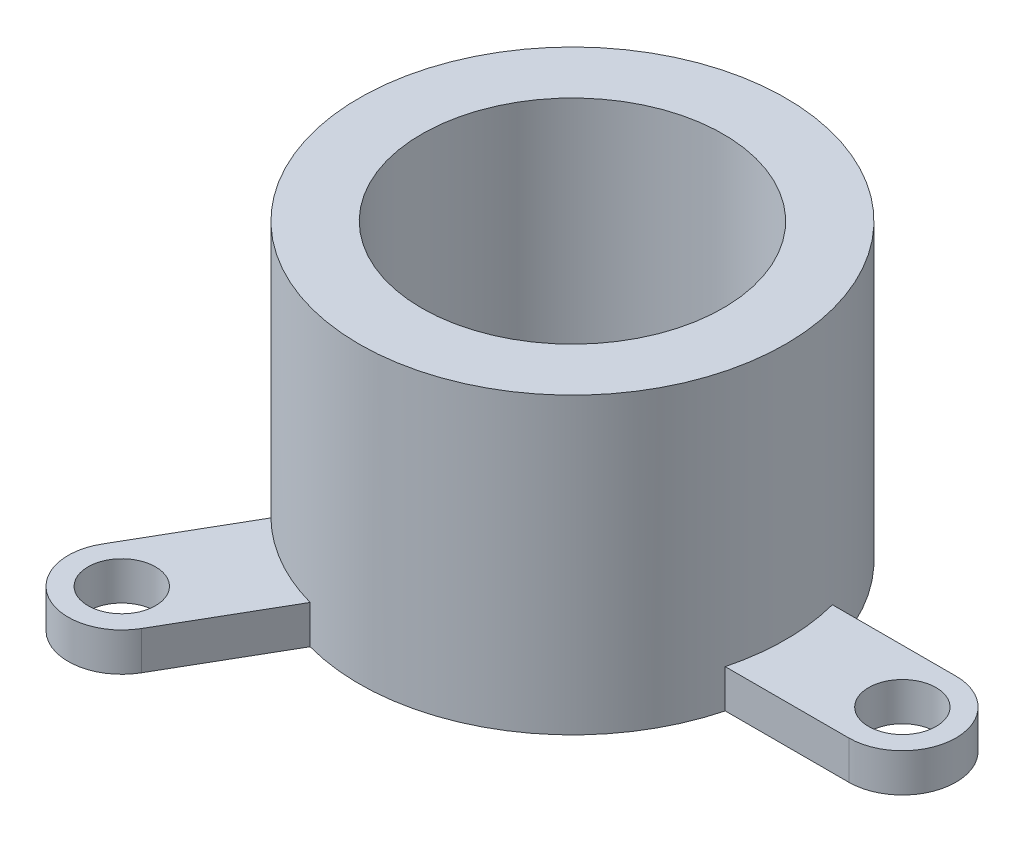
ISO-10303-21;
HEADER;
FILE_DESCRIPTION(('STEP AP214'),'2;1');
FILE_NAME('part.step','',(''),(''),'','','');
FILE_SCHEMA(('AUTOMOTIVE_DESIGN { 1 0 10303 214 1 1 1 1 }'));
ENDSEC;
DATA;
#1=APPLICATION_CONTEXT('core data for automotive mechanical design processes');
#2=APPLICATION_PROTOCOL_DEFINITION('international standard','automotive_design',2000,#1);
#3=PRODUCT_CONTEXT('',#1,'mechanical');
#4=PRODUCT('Part','Part','',(#3));
#5=PRODUCT_RELATED_PRODUCT_CATEGORY('part','',(#4));
#6=PRODUCT_DEFINITION_FORMATION('','',#4);
#7=PRODUCT_DEFINITION_CONTEXT('part definition',#1,'design');
#8=PRODUCT_DEFINITION('design','',#6,#7);
#9=PRODUCT_DEFINITION_SHAPE('','',#8);
#10=(LENGTH_UNIT() NAMED_UNIT(*) SI_UNIT(.MILLI.,.METRE.));
#11=(NAMED_UNIT(*) PLANE_ANGLE_UNIT() SI_UNIT($,.RADIAN.));
#12=(NAMED_UNIT(*) SI_UNIT($,.STERADIAN.) SOLID_ANGLE_UNIT());
#13=UNCERTAINTY_MEASURE_WITH_UNIT(LENGTH_MEASURE(1.E-05),#10,'distance_accuracy_value','');
#14=(GEOMETRIC_REPRESENTATION_CONTEXT(3) GLOBAL_UNCERTAINTY_ASSIGNED_CONTEXT((#13)) GLOBAL_UNIT_ASSIGNED_CONTEXT((#10,
#11,#12)) REPRESENTATION_CONTEXT('',''));
#15=CARTESIAN_POINT('',(0.,0.,0.));
#16=DIRECTION('',(0.,0.,1.));
#17=DIRECTION('',(1.,0.,0.));
#18=AXIS2_PLACEMENT_3D('',#15,#16,#17);
#19=CARTESIAN_POINT('',(0.,69.,0.));
#20=DIRECTION('',(0.,1.,0.));
#21=DIRECTION('',(0.,0.,1.));
#22=AXIS2_PLACEMENT_3D('',#19,#20,#21);
#23=PLANE('',#22);
#24=CARTESIAN_POINT('',(0.,69.,0.));
#25=DIRECTION('',(0.,1.,0.));
#26=DIRECTION('',(0.,0.,1.));
#27=AXIS2_PLACEMENT_3D('',#24,#25,#26);
#28=CIRCLE('',#27,50.);
#29=CARTESIAN_POINT('',(0.,69.,50.));
#30=VERTEX_POINT('',#29);
#31=EDGE_CURVE('E11',#30,#30,#28,.T.);
#32=ORIENTED_EDGE('',*,*,#31,.T.);
#33=EDGE_LOOP('',(#32));
#34=FACE_BOUND('',#33,.T.);
#35=CARTESIAN_POINT('',(0.,69.,0.));
#36=DIRECTION('',(0.,1.,0.));
#37=DIRECTION('',(0.,0.,1.));
#38=AXIS2_PLACEMENT_3D('',#35,#36,#37);
#39=CIRCLE('',#38,35.3553390593274);
#40=CARTESIAN_POINT('',(0.,69.,35.3553390593274));
#41=VERTEX_POINT('',#40);
#42=EDGE_CURVE('E233',#41,#41,#39,.T.);
#43=ORIENTED_EDGE('',*,*,#42,.F.);
#44=EDGE_LOOP('',(#43));
#45=FACE_BOUND('',#44,.T.);
#46=ADVANCED_FACE('F33',(#34,#45),#23,.T.);
#47=CARTESIAN_POINT('',(0.,0.,0.));
#48=DIRECTION('',(0.,1.,0.));
#49=DIRECTION('',(0.,0.,1.));
#50=AXIS2_PLACEMENT_3D('',#47,#48,#49);
#51=PLANE('',#50);
#52=CARTESIAN_POINT('',(0.,0.,0.));
#53=DIRECTION('',(0.,1.,0.));
#54=DIRECTION('',(0.,0.,1.));
#55=AXIS2_PLACEMENT_3D('',#52,#53,#54);
#56=CIRCLE('',#55,50.);
#57=CARTESIAN_POINT('',(48.3955633466447,0.,-12.564610951434));
#58=VERTEX_POINT('',#57);
#59=CARTESIAN_POINT('',(-13.3165094007126,0.,-48.1940927643703));
#60=VERTEX_POINT('',#59);
#61=EDGE_CURVE('E37',#58,#60,#56,.T.);
#62=ORIENTED_EDGE('',*,*,#61,.F.);
#63=DIRECTION('',(1.,0.,0.));
#64=VECTOR('',#63,1.);
#65=CARTESIAN_POINT('',(77.3632297465945,0.,-12.564610951434));
#66=LINE('',#65,#64);
#67=CARTESIAN_POINT('',(77.3632297465945,0.,-12.564610951434));
#68=VERTEX_POINT('',#67);
#69=EDGE_CURVE('E207',#58,#68,#66,.T.);
#70=ORIENTED_EDGE('',*,*,#69,.T.);
#71=CARTESIAN_POINT('',(77.3632297465945,0.,0.));
#72=DIRECTION('',(0.,-1.,0.));
#73=DIRECTION('',(0.,0.,-1.));
#74=AXIS2_PLACEMENT_3D('',#71,#72,#73);
#75=CIRCLE('',#74,12.564610951434);
#76=CARTESIAN_POINT('',(77.3632297465945,0.,12.564610951434));
#77=VERTEX_POINT('',#76);
#78=EDGE_CURVE('E200',#68,#77,#75,.T.);
#79=ORIENTED_EDGE('',*,*,#78,.T.);
#80=DIRECTION('',(-1.,0.,0.));
#81=VECTOR('',#80,1.);
#82=CARTESIAN_POINT('',(77.3632297465945,0.,12.564610951434));
#83=LINE('',#82,#81);
#84=CARTESIAN_POINT('',(48.3955633466447,0.,12.564610951434));
#85=VERTEX_POINT('',#84);
#86=EDGE_CURVE('E218',#77,#85,#83,.T.);
#87=ORIENTED_EDGE('',*,*,#86,.T.);
#88=CARTESIAN_POINT('',(-13.3165094007119,0.,48.1940927643705));
#89=VERTEX_POINT('',#88);
#90=EDGE_CURVE('E236',#89,#85,#56,.T.);
#91=ORIENTED_EDGE('',*,*,#90,.F.);
#92=DIRECTION('',(-0.499999999999992,0.,0.866025403784443));
#93=VECTOR('',#92,1.);
#94=CARTESIAN_POINT('',(-27.8003426006865,0.,73.28082775508));
#95=LINE('',#94,#93);
#96=CARTESIAN_POINT('',(-27.8003426006865,0.,73.28082775508));
#97=VERTEX_POINT('',#96);
#98=EDGE_CURVE('E142',#89,#97,#95,.T.);
#99=ORIENTED_EDGE('',*,*,#98,.T.);
#100=CARTESIAN_POINT('',(-38.6816148732966,0.,66.9985222793631));
#101=DIRECTION('',(0.,-1.,0.));
#102=DIRECTION('',(0.866025403784443,0.,0.499999999999992));
#103=AXIS2_PLACEMENT_3D('',#100,#101,#102);
#104=CIRCLE('',#103,12.564610951434);
#105=CARTESIAN_POINT('',(-49.5628871459067,0.,60.7162168036462));
#106=VERTEX_POINT('',#105);
#107=EDGE_CURVE('E152',#97,#106,#104,.T.);
#108=ORIENTED_EDGE('',*,*,#107,.T.);
#109=DIRECTION('',(0.499999999999992,0.,-0.866025403784443));
#110=VECTOR('',#109,1.);
#111=CARTESIAN_POINT('',(-49.5628871459067,0.,60.7162168036462));
#112=LINE('',#111,#110);
#113=CARTESIAN_POINT('',(-35.0790539459321,0.,35.6294818129367));
#114=VERTEX_POINT('',#113);
#115=EDGE_CURVE('E126',#106,#114,#112,.T.);
#116=ORIENTED_EDGE('',*,*,#115,.T.);
#117=CARTESIAN_POINT('',(-35.0790539459326,0.,-35.6294818129362));
#118=VERTEX_POINT('',#117);
#119=EDGE_CURVE('E270',#118,#114,#56,.T.);
#120=ORIENTED_EDGE('',*,*,#119,.F.);
#121=DIRECTION('',(-0.500000000000004,0.,-0.866025403784436));
#122=VECTOR('',#121,1.);
#123=CARTESIAN_POINT('',(-49.5628871459075,0.,-60.7162168036455));
#124=LINE('',#123,#122);
#125=CARTESIAN_POINT('',(-49.5628871459075,0.,-60.7162168036455));
#126=VERTEX_POINT('',#125);
#127=EDGE_CURVE('E171',#118,#126,#124,.T.);
#128=ORIENTED_EDGE('',*,*,#127,.T.);
#129=CARTESIAN_POINT('',(-38.6816148732975,0.,-66.9985222793626));
#130=DIRECTION('',(0.,-1.,0.));
#131=DIRECTION('',(-0.866025403784436,0.,0.500000000000004));
#132=AXIS2_PLACEMENT_3D('',#129,#130,#131);
#133=CIRCLE('',#132,12.564610951434);
#134=CARTESIAN_POINT('',(-27.8003426006876,0.,-73.2808277550796));
#135=VERTEX_POINT('',#134);
#136=EDGE_CURVE('E164',#126,#135,#133,.T.);
#137=ORIENTED_EDGE('',*,*,#136,.T.);
#138=DIRECTION('',(0.500000000000004,0.,0.866025403784437));
#139=VECTOR('',#138,1.);
#140=CARTESIAN_POINT('',(-27.8003426006876,0.,-73.2808277550796));
#141=LINE('',#140,#139);
#142=EDGE_CURVE('E182',#135,#60,#141,.T.);
#143=ORIENTED_EDGE('',*,*,#142,.T.);
#144=EDGE_LOOP('',(#62,#70,#79,#87,#91,#99,#108,#116,#120,#128,#137,#143));
#145=FACE_BOUND('',#144,.T.);
#146=CARTESIAN_POINT('',(0.,0.,0.));
#147=DIRECTION('',(0.,1.,0.));
#148=DIRECTION('',(0.,0.,1.));
#149=AXIS2_PLACEMENT_3D('',#146,#147,#148);
#150=CIRCLE('',#149,35.3553390593274);
#151=CARTESIAN_POINT('',(0.,0.,35.3553390593274));
#152=VERTEX_POINT('',#151);
#153=EDGE_CURVE('E225',#152,#152,#150,.T.);
#154=ORIENTED_EDGE('',*,*,#153,.T.);
#155=EDGE_LOOP('',(#154));
#156=FACE_BOUND('',#155,.T.);
#157=CARTESIAN_POINT('',(77.3632297465945,0.,0.));
#158=DIRECTION('',(0.,-1.,0.));
#159=DIRECTION('',(0.,0.,-1.));
#160=AXIS2_PLACEMENT_3D('',#157,#158,#159);
#161=CIRCLE('',#160,7.91120778203049);
#162=CARTESIAN_POINT('',(77.3632297465945,0.,-7.91120778203049));
#163=VERTEX_POINT('',#162);
#164=EDGE_CURVE('E189',#163,#163,#161,.T.);
#165=ORIENTED_EDGE('',*,*,#164,.F.);
#166=EDGE_LOOP('',(#165));
#167=FACE_BOUND('',#166,.T.);
#168=CARTESIAN_POINT('',(-38.6816148732975,0.,-66.9985222793626));
#169=DIRECTION('',(0.,-1.,0.));
#170=DIRECTION('',(-0.866025403784436,0.,0.500000000000004));
#171=AXIS2_PLACEMENT_3D('',#168,#169,#170);
#172=CIRCLE('',#171,7.91120778203049);
#173=CARTESIAN_POINT('',(-45.5329217871531,0.,-63.0429183883473));
#174=VERTEX_POINT('',#173);
#175=EDGE_CURVE('E157',#174,#174,#172,.T.);
#176=ORIENTED_EDGE('',*,*,#175,.F.);
#177=EDGE_LOOP('',(#176));
#178=FACE_BOUND('',#177,.T.);
#179=CARTESIAN_POINT('',(-38.6816148732966,0.,66.9985222793631));
#180=DIRECTION('',(0.,-1.,0.));
#181=DIRECTION('',(0.866025403784443,0.,0.499999999999992));
#182=AXIS2_PLACEMENT_3D('',#179,#180,#181);
#183=CIRCLE('',#182,7.91120778203049);
#184=CARTESIAN_POINT('',(-31.830307959441,0.,70.9541261703783));
#185=VERTEX_POINT('',#184);
#186=EDGE_CURVE('E147',#185,#185,#183,.T.);
#187=ORIENTED_EDGE('',*,*,#186,.F.);
#188=EDGE_LOOP('',(#187));
#189=FACE_BOUND('',#188,.T.);
#190=ADVANCED_FACE('F240',(#145,#156,#167,#178,#189),#51,.F.);
#191=CARTESIAN_POINT('',(0.,69.,0.));
#192=DIRECTION('',(0.,-1.,0.));
#193=DIRECTION('',(0.,0.,-1.));
#194=AXIS2_PLACEMENT_3D('',#191,#192,#193);
#195=CYLINDRICAL_SURFACE('',#194,50.);
#196=ORIENTED_EDGE('',*,*,#31,.F.);
#197=EDGE_LOOP('',(#196));
#198=FACE_BOUND('',#197,.T.);
#199=CARTESIAN_POINT('',(0.,8.99999999999998,0.));
#200=DIRECTION('',(0.,1.,0.));
#201=DIRECTION('',(0.866025403784443,0.,0.499999999999992));
#202=AXIS2_PLACEMENT_3D('',#199,#200,#201);
#203=CIRCLE('',#202,50.);
#204=CARTESIAN_POINT('',(-35.0790539459321,8.99999999999998,35.6294818129367));
#205=VERTEX_POINT('',#204);
#206=CARTESIAN_POINT('',(-13.3165094007119,8.99999999999998,48.1940927643705));
#207=VERTEX_POINT('',#206);
#208=EDGE_CURVE('E52',#205,#207,#203,.T.);
#209=ORIENTED_EDGE('',*,*,#208,.T.);
#210=DIRECTION('',(0.,-1.,0.));
#211=VECTOR('',#210,1.);
#212=CARTESIAN_POINT('',(-13.3165094007119,8.99999999999998,48.1940927643705));
#213=LINE('',#212,#211);
#214=EDGE_CURVE('E158',#207,#89,#213,.T.);
#215=ORIENTED_EDGE('',*,*,#214,.T.);
#216=ORIENTED_EDGE('',*,*,#90,.T.);
#217=DIRECTION('',(0.,-1.,0.));
#218=VECTOR('',#217,1.);
#219=CARTESIAN_POINT('',(48.3955633466447,8.99999999999998,12.564610951434));
#220=LINE('',#219,#218);
#221=CARTESIAN_POINT('',(48.3955633466447,8.99999999999998,12.564610951434));
#222=VERTEX_POINT('',#221);
#223=EDGE_CURVE('E229',#222,#85,#220,.T.);
#224=ORIENTED_EDGE('',*,*,#223,.F.);
#225=CARTESIAN_POINT('',(0.,8.99999999999998,0.));
#226=DIRECTION('',(0.,1.,0.));
#227=DIRECTION('',(0.,0.,-1.));
#228=AXIS2_PLACEMENT_3D('',#225,#226,#227);
#229=CIRCLE('',#228,50.);
#230=CARTESIAN_POINT('',(48.3955633466448,8.99999999999998,-12.564610951434));
#231=VERTEX_POINT('',#230);
#232=EDGE_CURVE('E210',#222,#231,#229,.T.);
#233=ORIENTED_EDGE('',*,*,#232,.T.);
#234=DIRECTION('',(0.,-1.,0.));
#235=VECTOR('',#234,1.);
#236=CARTESIAN_POINT('',(48.3955633466447,8.99999999999998,-12.564610951434));
#237=LINE('',#236,#235);
#238=EDGE_CURVE('E226',#231,#58,#237,.T.);
#239=ORIENTED_EDGE('',*,*,#238,.T.);
#240=ORIENTED_EDGE('',*,*,#61,.T.);
#241=DIRECTION('',(0.,-1.,0.));
#242=VECTOR('',#241,1.);
#243=CARTESIAN_POINT('',(-13.3165094007126,8.99999999999998,-48.1940927643703));
#244=LINE('',#243,#242);
#245=CARTESIAN_POINT('',(-13.3165094007126,8.99999999999998,-48.1940927643703));
#246=VERTEX_POINT('',#245);
#247=EDGE_CURVE('E193',#246,#60,#244,.T.);
#248=ORIENTED_EDGE('',*,*,#247,.F.);
#249=CARTESIAN_POINT('',(0.,8.99999999999998,0.));
#250=DIRECTION('',(0.,1.,0.));
#251=DIRECTION('',(-0.866025403784436,0.,0.500000000000004));
#252=AXIS2_PLACEMENT_3D('',#249,#250,#251);
#253=CIRCLE('',#252,50.);
#254=CARTESIAN_POINT('',(-35.0790539459326,8.99999999999998,-35.6294818129362));
#255=VERTEX_POINT('',#254);
#256=EDGE_CURVE('E174',#246,#255,#253,.T.);
#257=ORIENTED_EDGE('',*,*,#256,.T.);
#258=DIRECTION('',(0.,-1.,0.));
#259=VECTOR('',#258,1.);
#260=CARTESIAN_POINT('',(-35.0790539459326,8.99999999999998,-35.6294818129362));
#261=LINE('',#260,#259);
#262=EDGE_CURVE('E190',#255,#118,#261,.T.);
#263=ORIENTED_EDGE('',*,*,#262,.T.);
#264=ORIENTED_EDGE('',*,*,#119,.T.);
#265=DIRECTION('',(0.,-1.,0.));
#266=VECTOR('',#265,1.);
#267=CARTESIAN_POINT('',(-35.0790539459321,8.99999999999998,35.6294818129367));
#268=LINE('',#267,#266);
#269=EDGE_CURVE('E48',#205,#114,#268,.T.);
#270=ORIENTED_EDGE('',*,*,#269,.F.);
#271=EDGE_LOOP('',(#209,#215,#216,#224,#233,#239,#240,#248,#257,#263,#264,#270));
#272=FACE_BOUND('',#271,.T.);
#273=ADVANCED_FACE('F35',(#198,#272),#195,.T.);
#274=CARTESIAN_POINT('',(0.,69.,0.));
#275=DIRECTION('',(0.,-1.,0.));
#276=DIRECTION('',(0.,0.,-1.));
#277=AXIS2_PLACEMENT_3D('',#274,#275,#276);
#278=CYLINDRICAL_SURFACE('',#277,35.3553390593274);
#279=ORIENTED_EDGE('',*,*,#42,.T.);
#280=EDGE_LOOP('',(#279));
#281=FACE_BOUND('',#280,.T.);
#282=ORIENTED_EDGE('',*,*,#153,.F.);
#283=EDGE_LOOP('',(#282));
#284=FACE_BOUND('',#283,.T.);
#285=ADVANCED_FACE('F243',(#281,#284),#278,.F.);
#286=CARTESIAN_POINT('',(77.3632297465945,8.99999999999998,0.));
#287=DIRECTION('',(0.,-1.,0.));
#288=DIRECTION('',(0.,0.,-1.));
#289=AXIS2_PLACEMENT_3D('',#286,#287,#288);
#290=CYLINDRICAL_SURFACE('',#289,12.564610951434);
#291=ORIENTED_EDGE('',*,*,#78,.F.);
#292=DIRECTION('',(0.,-1.,0.));
#293=VECTOR('',#292,1.);
#294=CARTESIAN_POINT('',(77.3632297465945,8.99999999999998,-12.564610951434));
#295=LINE('',#294,#293);
#296=CARTESIAN_POINT('',(77.3632297465945,8.99999999999998,-12.564610951434));
#297=VERTEX_POINT('',#296);
#298=EDGE_CURVE('E223',#297,#68,#295,.T.);
#299=ORIENTED_EDGE('',*,*,#298,.F.);
#300=CARTESIAN_POINT('',(77.3632297465945,8.99999999999998,0.));
#301=DIRECTION('',(0.,-1.,0.));
#302=DIRECTION('',(0.,0.,-1.));
#303=AXIS2_PLACEMENT_3D('',#300,#301,#302);
#304=CIRCLE('',#303,12.564610951434);
#305=CARTESIAN_POINT('',(77.3632297465945,8.99999999999998,12.564610951434));
#306=VERTEX_POINT('',#305);
#307=EDGE_CURVE('E203',#297,#306,#304,.T.);
#308=ORIENTED_EDGE('',*,*,#307,.T.);
#309=DIRECTION('',(0.,-1.,0.));
#310=VECTOR('',#309,1.);
#311=CARTESIAN_POINT('',(77.3632297465945,8.99999999999998,12.564610951434));
#312=LINE('',#311,#310);
#313=EDGE_CURVE('E215',#306,#77,#312,.T.);
#314=ORIENTED_EDGE('',*,*,#313,.T.);
#315=EDGE_LOOP('',(#291,#299,#308,#314));
#316=FACE_BOUND('',#315,.T.);
#317=ADVANCED_FACE('F245',(#316),#290,.T.);
#318=CARTESIAN_POINT('',(77.3632297465945,8.99999999999998,-12.564610951434));
#319=DIRECTION('',(0.,0.,-1.));
#320=DIRECTION('',(-1.,0.,0.));
#321=AXIS2_PLACEMENT_3D('',#318,#319,#320);
#322=PLANE('',#321);
#323=ORIENTED_EDGE('',*,*,#69,.F.);
#324=ORIENTED_EDGE('',*,*,#238,.F.);
#325=DIRECTION('',(1.,0.,0.));
#326=VECTOR('',#325,1.);
#327=CARTESIAN_POINT('',(77.3632297465945,8.99999999999998,-12.564610951434));
#328=LINE('',#327,#326);
#329=EDGE_CURVE('E212',#231,#297,#328,.T.);
#330=ORIENTED_EDGE('',*,*,#329,.T.);
#331=ORIENTED_EDGE('',*,*,#298,.T.);
#332=EDGE_LOOP('',(#323,#324,#330,#331));
#333=FACE_BOUND('',#332,.T.);
#334=ADVANCED_FACE('F252',(#333),#322,.T.);
#335=CARTESIAN_POINT('',(77.3632297465945,8.99999999999998,12.564610951434));
#336=DIRECTION('',(0.,0.,1.));
#337=DIRECTION('',(1.,0.,0.));
#338=AXIS2_PLACEMENT_3D('',#335,#336,#337);
#339=PLANE('',#338);
#340=ORIENTED_EDGE('',*,*,#86,.F.);
#341=ORIENTED_EDGE('',*,*,#313,.F.);
#342=DIRECTION('',(-1.,0.,0.));
#343=VECTOR('',#342,1.);
#344=CARTESIAN_POINT('',(77.3632297465945,8.99999999999998,12.564610951434));
#345=LINE('',#344,#343);
#346=EDGE_CURVE('E206',#306,#222,#345,.T.);
#347=ORIENTED_EDGE('',*,*,#346,.T.);
#348=ORIENTED_EDGE('',*,*,#223,.T.);
#349=EDGE_LOOP('',(#340,#341,#347,#348));
#350=FACE_BOUND('',#349,.T.);
#351=ADVANCED_FACE('F279',(#350),#339,.T.);
#352=CARTESIAN_POINT('',(77.3632297465945,8.99999999999998,0.));
#353=DIRECTION('',(0.,-1.,0.));
#354=DIRECTION('',(0.,0.,-1.));
#355=AXIS2_PLACEMENT_3D('',#352,#353,#354);
#356=PLANE('',#355);
#357=CARTESIAN_POINT('',(77.3632297465945,8.99999999999998,0.));
#358=DIRECTION('',(0.,-1.,0.));
#359=DIRECTION('',(0.,0.,-1.));
#360=AXIS2_PLACEMENT_3D('',#357,#358,#359);
#361=CIRCLE('',#360,7.91120778203049);
#362=CARTESIAN_POINT('',(77.3632297465945,8.99999999999998,-7.91120778203049));
#363=VERTEX_POINT('',#362);
#364=EDGE_CURVE('E197',#363,#363,#361,.T.);
#365=ORIENTED_EDGE('',*,*,#364,.T.);
#366=EDGE_LOOP('',(#365));
#367=FACE_BOUND('',#366,.T.);
#368=ORIENTED_EDGE('',*,*,#307,.F.);
#369=ORIENTED_EDGE('',*,*,#329,.F.);
#370=ORIENTED_EDGE('',*,*,#232,.F.);
#371=ORIENTED_EDGE('',*,*,#346,.F.);
#372=EDGE_LOOP('',(#368,#369,#370,#371));
#373=FACE_BOUND('',#372,.T.);
#374=ADVANCED_FACE('F282',(#367,#373),#356,.F.);
#375=CARTESIAN_POINT('',(77.3632297465945,8.99999999999998,0.));
#376=DIRECTION('',(0.,-1.,0.));
#377=DIRECTION('',(0.,0.,-1.));
#378=AXIS2_PLACEMENT_3D('',#375,#376,#377);
#379=CYLINDRICAL_SURFACE('',#378,7.91120778203049);
#380=ORIENTED_EDGE('',*,*,#364,.F.);
#381=EDGE_LOOP('',(#380));
#382=FACE_BOUND('',#381,.T.);
#383=ORIENTED_EDGE('',*,*,#164,.T.);
#384=EDGE_LOOP('',(#383));
#385=FACE_BOUND('',#384,.T.);
#386=ADVANCED_FACE('F284',(#382,#385),#379,.F.);
#387=CARTESIAN_POINT('',(-38.6816148732975,8.99999999999998,-66.9985222793626));
#388=DIRECTION('',(0.,-1.,0.));
#389=DIRECTION('',(0.,0.,-1.));
#390=AXIS2_PLACEMENT_3D('',#387,#388,#389);
#391=CYLINDRICAL_SURFACE('',#390,12.564610951434);
#392=ORIENTED_EDGE('',*,*,#136,.F.);
#393=DIRECTION('',(0.,-1.,0.));
#394=VECTOR('',#393,1.);
#395=CARTESIAN_POINT('',(-49.5628871459075,8.99999999999998,-60.7162168036455));
#396=LINE('',#395,#394);
#397=CARTESIAN_POINT('',(-49.5628871459075,8.99999999999998,-60.7162168036455));
#398=VERTEX_POINT('',#397);
#399=EDGE_CURVE('E187',#398,#126,#396,.T.);
#400=ORIENTED_EDGE('',*,*,#399,.F.);
#401=CARTESIAN_POINT('',(-38.6816148732975,8.99999999999998,-66.9985222793626));
#402=DIRECTION('',(0.,-1.,0.));
#403=DIRECTION('',(-0.866025403784436,0.,0.500000000000004));
#404=AXIS2_PLACEMENT_3D('',#401,#402,#403);
#405=CIRCLE('',#404,12.564610951434);
#406=CARTESIAN_POINT('',(-27.8003426006876,8.99999999999998,-73.2808277550796));
#407=VERTEX_POINT('',#406);
#408=EDGE_CURVE('E167',#398,#407,#405,.T.);
#409=ORIENTED_EDGE('',*,*,#408,.T.);
#410=DIRECTION('',(0.,-1.,0.));
#411=VECTOR('',#410,1.);
#412=CARTESIAN_POINT('',(-27.8003426006876,8.99999999999998,-73.2808277550796));
#413=LINE('',#412,#411);
#414=EDGE_CURVE('E179',#407,#135,#413,.T.);
#415=ORIENTED_EDGE('',*,*,#414,.T.);
#416=EDGE_LOOP('',(#392,#400,#409,#415));
#417=FACE_BOUND('',#416,.T.);
#418=ADVANCED_FACE('F291',(#417),#391,.T.);
#419=CARTESIAN_POINT('',(-49.5628871459075,8.99999999999998,-60.7162168036455));
#420=DIRECTION('',(-0.866025403784436,0.,0.500000000000004));
#421=DIRECTION('',(0.500000000000004,0.,0.866025403784436));
#422=AXIS2_PLACEMENT_3D('',#419,#420,#421);
#423=PLANE('',#422);
#424=ORIENTED_EDGE('',*,*,#127,.F.);
#425=ORIENTED_EDGE('',*,*,#262,.F.);
#426=DIRECTION('',(-0.500000000000004,0.,-0.866025403784436));
#427=VECTOR('',#426,1.);
#428=CARTESIAN_POINT('',(-49.5628871459075,8.99999999999998,-60.7162168036455));
#429=LINE('',#428,#427);
#430=EDGE_CURVE('E176',#255,#398,#429,.T.);
#431=ORIENTED_EDGE('',*,*,#430,.T.);
#432=ORIENTED_EDGE('',*,*,#399,.T.);
#433=EDGE_LOOP('',(#424,#425,#431,#432));
#434=FACE_BOUND('',#433,.T.);
#435=ADVANCED_FACE('F338',(#434),#423,.T.);
#436=CARTESIAN_POINT('',(-27.8003426006876,8.99999999999998,-73.2808277550796));
#437=DIRECTION('',(0.866025403784436,0.,-0.500000000000004));
#438=DIRECTION('',(-0.500000000000004,0.,-0.866025403784437));
#439=AXIS2_PLACEMENT_3D('',#436,#437,#438);
#440=PLANE('',#439);
#441=ORIENTED_EDGE('',*,*,#142,.F.);
#442=ORIENTED_EDGE('',*,*,#414,.F.);
#443=DIRECTION('',(0.500000000000004,0.,0.866025403784437));
#444=VECTOR('',#443,1.);
#445=CARTESIAN_POINT('',(-27.8003426006876,8.99999999999998,-73.2808277550796));
#446=LINE('',#445,#444);
#447=EDGE_CURVE('E170',#407,#246,#446,.T.);
#448=ORIENTED_EDGE('',*,*,#447,.T.);
#449=ORIENTED_EDGE('',*,*,#247,.T.);
#450=EDGE_LOOP('',(#441,#442,#448,#449));
#451=FACE_BOUND('',#450,.T.);
#452=ADVANCED_FACE('F347',(#451),#440,.T.);
#453=CARTESIAN_POINT('',(-38.6816148732975,8.99999999999998,-66.9985222793626));
#454=DIRECTION('',(0.,-1.,0.));
#455=DIRECTION('',(-0.866025403784436,0.,0.500000000000004));
#456=AXIS2_PLACEMENT_3D('',#453,#454,#455);
#457=PLANE('',#456);
#458=CARTESIAN_POINT('',(-38.6816148732975,8.99999999999998,-66.9985222793626));
#459=DIRECTION('',(0.,-1.,0.));
#460=DIRECTION('',(-0.866025403784436,0.,0.500000000000004));
#461=AXIS2_PLACEMENT_3D('',#458,#459,#460);
#462=CIRCLE('',#461,7.91120778203049);
#463=CARTESIAN_POINT('',(-45.5329217871531,8.99999999999998,-63.0429183883473));
#464=VERTEX_POINT('',#463);
#465=EDGE_CURVE('E161',#464,#464,#462,.T.);
#466=ORIENTED_EDGE('',*,*,#465,.T.);
#467=EDGE_LOOP('',(#466));
#468=FACE_BOUND('',#467,.T.);
#469=ORIENTED_EDGE('',*,*,#408,.F.);
#470=ORIENTED_EDGE('',*,*,#430,.F.);
#471=ORIENTED_EDGE('',*,*,#256,.F.);
#472=ORIENTED_EDGE('',*,*,#447,.F.);
#473=EDGE_LOOP('',(#469,#470,#471,#472));
#474=FACE_BOUND('',#473,.T.);
#475=ADVANCED_FACE('F357',(#468,#474),#457,.F.);
#476=CARTESIAN_POINT('',(-38.6816148732975,8.99999999999998,-66.9985222793626));
#477=DIRECTION('',(0.,-1.,0.));
#478=DIRECTION('',(0.,0.,-1.));
#479=AXIS2_PLACEMENT_3D('',#476,#477,#478);
#480=CYLINDRICAL_SURFACE('',#479,7.91120778203049);
#481=ORIENTED_EDGE('',*,*,#465,.F.);
#482=EDGE_LOOP('',(#481));
#483=FACE_BOUND('',#482,.T.);
#484=ORIENTED_EDGE('',*,*,#175,.T.);
#485=EDGE_LOOP('',(#484));
#486=FACE_BOUND('',#485,.T.);
#487=ADVANCED_FACE('F367',(#483,#486),#480,.F.);
#488=CARTESIAN_POINT('',(-38.6816148732966,8.99999999999998,66.9985222793631));
#489=DIRECTION('',(0.,-1.,0.));
#490=DIRECTION('',(0.,0.,-1.));
#491=AXIS2_PLACEMENT_3D('',#488,#489,#490);
#492=CYLINDRICAL_SURFACE('',#491,12.564610951434);
#493=ORIENTED_EDGE('',*,*,#107,.F.);
#494=DIRECTION('',(0.,-1.,0.));
#495=VECTOR('',#494,1.);
#496=CARTESIAN_POINT('',(-27.8003426006865,8.99999999999998,73.28082775508));
#497=LINE('',#496,#495);
#498=CARTESIAN_POINT('',(-27.8003426006865,8.99999999999998,73.28082775508));
#499=VERTEX_POINT('',#498);
#500=EDGE_CURVE('E141',#499,#97,#497,.T.);
#501=ORIENTED_EDGE('',*,*,#500,.F.);
#502=CARTESIAN_POINT('',(-38.6816148732966,8.99999999999998,66.9985222793631));
#503=DIRECTION('',(0.,-1.,0.));
#504=DIRECTION('',(0.866025403784443,0.,0.499999999999992));
#505=AXIS2_PLACEMENT_3D('',#502,#503,#504);
#506=CIRCLE('',#505,12.564610951434);
#507=CARTESIAN_POINT('',(-49.5628871459067,8.99999999999998,60.7162168036462));
#508=VERTEX_POINT('',#507);
#509=EDGE_CURVE('E137',#499,#508,#506,.T.);
#510=ORIENTED_EDGE('',*,*,#509,.T.);
#511=DIRECTION('',(0.,-1.,0.));
#512=VECTOR('',#511,1.);
#513=CARTESIAN_POINT('',(-49.5628871459067,8.99999999999998,60.7162168036462));
#514=LINE('',#513,#512);
#515=EDGE_CURVE('E121',#508,#106,#514,.T.);
#516=ORIENTED_EDGE('',*,*,#515,.T.);
#517=EDGE_LOOP('',(#493,#501,#510,#516));
#518=FACE_BOUND('',#517,.T.);
#519=ADVANCED_FACE('F140',(#518),#492,.T.);
#520=CARTESIAN_POINT('',(-27.8003426006865,8.99999999999998,73.28082775508));
#521=DIRECTION('',(0.866025403784443,0.,0.499999999999992));
#522=DIRECTION('',(0.499999999999992,0.,-0.866025403784443));
#523=AXIS2_PLACEMENT_3D('',#520,#521,#522);
#524=PLANE('',#523);
#525=ORIENTED_EDGE('',*,*,#98,.F.);
#526=ORIENTED_EDGE('',*,*,#214,.F.);
#527=DIRECTION('',(-0.499999999999992,0.,0.866025403784443));
#528=VECTOR('',#527,1.);
#529=CARTESIAN_POINT('',(-27.8003426006865,8.99999999999998,73.28082775508));
#530=LINE('',#529,#528);
#531=EDGE_CURVE('E131',#207,#499,#530,.T.);
#532=ORIENTED_EDGE('',*,*,#531,.T.);
#533=ORIENTED_EDGE('',*,*,#500,.T.);
#534=EDGE_LOOP('',(#525,#526,#532,#533));
#535=FACE_BOUND('',#534,.T.);
#536=ADVANCED_FACE('F386',(#535),#524,.T.);
#537=CARTESIAN_POINT('',(-49.5628871459067,8.99999999999998,60.7162168036462));
#538=DIRECTION('',(-0.866025403784443,0.,-0.499999999999992));
#539=DIRECTION('',(-0.499999999999992,0.,0.866025403784443));
#540=AXIS2_PLACEMENT_3D('',#537,#538,#539);
#541=PLANE('',#540);
#542=ORIENTED_EDGE('',*,*,#115,.F.);
#543=ORIENTED_EDGE('',*,*,#515,.F.);
#544=DIRECTION('',(0.499999999999992,0.,-0.866025403784443));
#545=VECTOR('',#544,1.);
#546=CARTESIAN_POINT('',(-49.5628871459067,8.99999999999998,60.7162168036462));
#547=LINE('',#546,#545);
#548=EDGE_CURVE('E124',#508,#205,#547,.T.);
#549=ORIENTED_EDGE('',*,*,#548,.T.);
#550=ORIENTED_EDGE('',*,*,#269,.T.);
#551=EDGE_LOOP('',(#542,#543,#549,#550));
#552=FACE_BOUND('',#551,.T.);
#553=ADVANCED_FACE('F123',(#552),#541,.T.);
#554=CARTESIAN_POINT('',(-38.6816148732966,8.99999999999998,66.9985222793631));
#555=DIRECTION('',(0.,-1.,0.));
#556=DIRECTION('',(0.866025403784443,0.,0.499999999999992));
#557=AXIS2_PLACEMENT_3D('',#554,#555,#556);
#558=PLANE('',#557);
#559=CARTESIAN_POINT('',(-38.6816148732966,8.99999999999998,66.9985222793631));
#560=DIRECTION('',(0.,-1.,0.));
#561=DIRECTION('',(0.866025403784443,0.,0.499999999999992));
#562=AXIS2_PLACEMENT_3D('',#559,#560,#561);
#563=CIRCLE('',#562,7.91120778203049);
#564=CARTESIAN_POINT('',(-31.830307959441,8.99999999999998,70.9541261703783));
#565=VERTEX_POINT('',#564);
#566=EDGE_CURVE('E154',#565,#565,#563,.T.);
#567=ORIENTED_EDGE('',*,*,#566,.T.);
#568=EDGE_LOOP('',(#567));
#569=FACE_BOUND('',#568,.T.);
#570=ORIENTED_EDGE('',*,*,#509,.F.);
#571=ORIENTED_EDGE('',*,*,#531,.F.);
#572=ORIENTED_EDGE('',*,*,#208,.F.);
#573=ORIENTED_EDGE('',*,*,#548,.F.);
#574=EDGE_LOOP('',(#570,#571,#572,#573));
#575=FACE_BOUND('',#574,.T.);
#576=ADVANCED_FACE('F135',(#569,#575),#558,.F.);
#577=CARTESIAN_POINT('',(-38.6816148732966,8.99999999999998,66.9985222793631));
#578=DIRECTION('',(0.,-1.,0.));
#579=DIRECTION('',(0.,0.,-1.));
#580=AXIS2_PLACEMENT_3D('',#577,#578,#579);
#581=CYLINDRICAL_SURFACE('',#580,7.91120778203049);
#582=ORIENTED_EDGE('',*,*,#566,.F.);
#583=EDGE_LOOP('',(#582));
#584=FACE_BOUND('',#583,.T.);
#585=ORIENTED_EDGE('',*,*,#186,.T.);
#586=EDGE_LOOP('',(#585));
#587=FACE_BOUND('',#586,.T.);
#588=ADVANCED_FACE('F412',(#584,#587),#581,.F.);
#589=CLOSED_SHELL('',(#46,#190,#273,#285,#317,#334,#351,#374,#386,#418,#435,#452,#475,#487,#519,
#536,#553,#576,#588));
#590=MANIFOLD_SOLID_BREP('B2',#589);
#591=ADVANCED_BREP_SHAPE_REPRESENTATION('',(#18,#590),#14);
#592=SHAPE_DEFINITION_REPRESENTATION(#9,#591);
ENDSEC;
END-ISO-10303-21;
